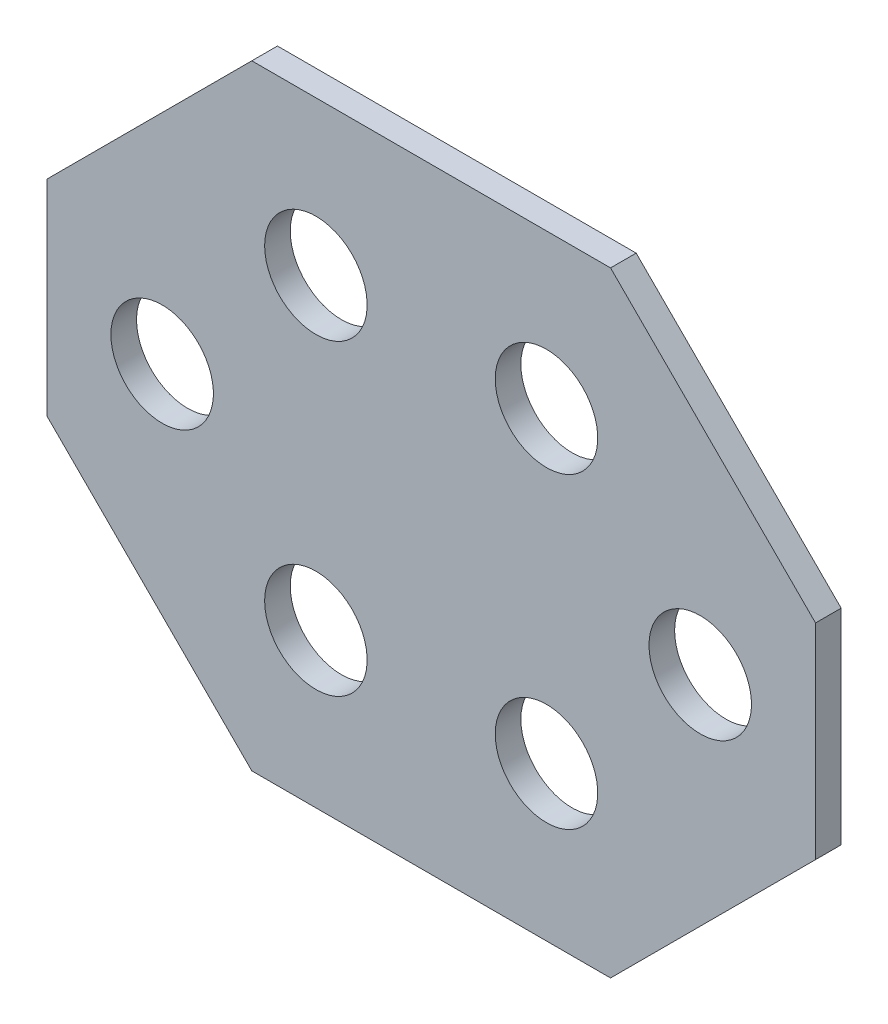
ISO-10303-21;
HEADER;
FILE_DESCRIPTION(('STEP AP214'),'2;1');
FILE_NAME('part.step','',(''),(''),'','','');
FILE_SCHEMA(('AUTOMOTIVE_DESIGN { 1 0 10303 214 1 1 1 1 }'));
ENDSEC;
DATA;
#1=APPLICATION_CONTEXT('core data for automotive mechanical design processes');
#2=APPLICATION_PROTOCOL_DEFINITION('international standard','automotive_design',2000,#1);
#3=PRODUCT_CONTEXT('',#1,'mechanical');
#4=PRODUCT('Part','Part','',(#3));
#5=PRODUCT_RELATED_PRODUCT_CATEGORY('part','',(#4));
#6=PRODUCT_DEFINITION_FORMATION('','',#4);
#7=PRODUCT_DEFINITION_CONTEXT('part definition',#1,'design');
#8=PRODUCT_DEFINITION('design','',#6,#7);
#9=PRODUCT_DEFINITION_SHAPE('','',#8);
#10=(LENGTH_UNIT() NAMED_UNIT(*) SI_UNIT(.MILLI.,.METRE.));
#11=(NAMED_UNIT(*) PLANE_ANGLE_UNIT() SI_UNIT($,.RADIAN.));
#12=(NAMED_UNIT(*) SI_UNIT($,.STERADIAN.) SOLID_ANGLE_UNIT());
#13=UNCERTAINTY_MEASURE_WITH_UNIT(LENGTH_MEASURE(1.E-05),#10,'distance_accuracy_value','');
#14=(GEOMETRIC_REPRESENTATION_CONTEXT(3) GLOBAL_UNCERTAINTY_ASSIGNED_CONTEXT((#13)) GLOBAL_UNIT_ASSIGNED_CONTEXT((#10,
#11,#12)) REPRESENTATION_CONTEXT('',''));
#15=CARTESIAN_POINT('',(0.,0.,0.));
#16=DIRECTION('',(0.,0.,1.));
#17=DIRECTION('',(1.,0.,0.));
#18=AXIS2_PLACEMENT_3D('',#15,#16,#17);
#19=CARTESIAN_POINT('',(15.,-12.,1.));
#20=DIRECTION('',(0.,-1.,0.));
#21=DIRECTION('',(1.,0.,0.));
#22=AXIS2_PLACEMENT_3D('',#19,#20,#21);
#23=PLANE('',#22);
#24=DIRECTION('',(-1.,0.,0.));
#25=VECTOR('',#24,1.);
#26=CARTESIAN_POINT('',(15.,-12.,1.));
#27=LINE('',#26,#25);
#28=CARTESIAN_POINT('',(6.99999999999997,-12.,1.));
#29=VERTEX_POINT('',#28);
#30=CARTESIAN_POINT('',(-7.,-12.,1.));
#31=VERTEX_POINT('',#30);
#32=EDGE_CURVE('E154',#29,#31,#27,.T.);
#33=ORIENTED_EDGE('',*,*,#32,.T.);
#34=DIRECTION('',(0.,0.,-1.));
#35=VECTOR('',#34,1.);
#36=CARTESIAN_POINT('',(-7.,-12.,1.));
#37=LINE('',#36,#35);
#38=CARTESIAN_POINT('',(-7.,-12.,0.));
#39=VERTEX_POINT('',#38);
#40=EDGE_CURVE('E150',#31,#39,#37,.T.);
#41=ORIENTED_EDGE('',*,*,#40,.T.);
#42=DIRECTION('',(-1.,0.,0.));
#43=VECTOR('',#42,1.);
#44=CARTESIAN_POINT('',(15.,-12.,0.));
#45=LINE('',#44,#43);
#46=CARTESIAN_POINT('',(6.99999999999997,-12.,0.));
#47=VERTEX_POINT('',#46);
#48=EDGE_CURVE('E103',#47,#39,#45,.T.);
#49=ORIENTED_EDGE('',*,*,#48,.F.);
#50=DIRECTION('',(0.,0.,1.));
#51=VECTOR('',#50,1.);
#52=CARTESIAN_POINT('',(6.99999999999997,-12.,1.));
#53=LINE('',#52,#51);
#54=EDGE_CURVE('E148',#47,#29,#53,.T.);
#55=ORIENTED_EDGE('',*,*,#54,.T.);
#56=EDGE_LOOP('',(#33,#41,#49,#55));
#57=FACE_BOUND('',#56,.T.);
#58=ADVANCED_FACE('F32',(#57),#23,.T.);
#59=CARTESIAN_POINT('',(15.,-12.,1.));
#60=DIRECTION('',(-1.,0.,0.));
#61=DIRECTION('',(0.,0.,1.));
#62=AXIS2_PLACEMENT_3D('',#59,#60,#61);
#63=PLANE('',#62);
#64=DIRECTION('',(0.,1.,0.));
#65=VECTOR('',#64,1.);
#66=CARTESIAN_POINT('',(15.,-12.,1.));
#67=LINE('',#66,#65);
#68=CARTESIAN_POINT('',(15.,-3.99999999999999,1.));
#69=VERTEX_POINT('',#68);
#70=CARTESIAN_POINT('',(15.,3.99999999999997,1.));
#71=VERTEX_POINT('',#70);
#72=EDGE_CURVE('E124',#69,#71,#67,.T.);
#73=ORIENTED_EDGE('',*,*,#72,.F.);
#74=DIRECTION('',(0.,0.,-1.));
#75=VECTOR('',#74,1.);
#76=CARTESIAN_POINT('',(15.,-3.99999999999999,0.));
#77=LINE('',#76,#75);
#78=CARTESIAN_POINT('',(15.,-3.99999999999999,0.));
#79=VERTEX_POINT('',#78);
#80=EDGE_CURVE('E11',#69,#79,#77,.T.);
#81=ORIENTED_EDGE('',*,*,#80,.T.);
#82=DIRECTION('',(0.,1.,0.));
#83=VECTOR('',#82,1.);
#84=CARTESIAN_POINT('',(15.,-12.,0.));
#85=LINE('',#84,#83);
#86=CARTESIAN_POINT('',(15.,3.99999999999997,0.));
#87=VERTEX_POINT('',#86);
#88=EDGE_CURVE('E131',#79,#87,#85,.T.);
#89=ORIENTED_EDGE('',*,*,#88,.T.);
#90=DIRECTION('',(0.,0.,1.));
#91=VECTOR('',#90,1.);
#92=CARTESIAN_POINT('',(15.,3.99999999999997,1.));
#93=LINE('',#92,#91);
#94=EDGE_CURVE('E40',#87,#71,#93,.T.);
#95=ORIENTED_EDGE('',*,*,#94,.T.);
#96=EDGE_LOOP('',(#73,#81,#89,#95));
#97=FACE_BOUND('',#96,.T.);
#98=ADVANCED_FACE('F178',(#97),#63,.F.);
#99=CARTESIAN_POINT('',(15.,12.,1.));
#100=DIRECTION('',(0.,-1.,0.));
#101=DIRECTION('',(1.,0.,0.));
#102=AXIS2_PLACEMENT_3D('',#99,#100,#101);
#103=PLANE('',#102);
#104=DIRECTION('',(-1.,0.,0.));
#105=VECTOR('',#104,1.);
#106=CARTESIAN_POINT('',(15.,12.,0.));
#107=LINE('',#106,#105);
#108=CARTESIAN_POINT('',(6.99999999999999,12.,0.));
#109=VERTEX_POINT('',#108);
#110=CARTESIAN_POINT('',(-6.99999999999997,12.,0.));
#111=VERTEX_POINT('',#110);
#112=EDGE_CURVE('E119',#109,#111,#107,.T.);
#113=ORIENTED_EDGE('',*,*,#112,.T.);
#114=DIRECTION('',(0.,0.,1.));
#115=VECTOR('',#114,1.);
#116=CARTESIAN_POINT('',(-6.99999999999997,12.,1.));
#117=LINE('',#116,#115);
#118=CARTESIAN_POINT('',(-6.99999999999997,12.,1.));
#119=VERTEX_POINT('',#118);
#120=EDGE_CURVE('E140',#111,#119,#117,.T.);
#121=ORIENTED_EDGE('',*,*,#120,.T.);
#122=DIRECTION('',(-1.,0.,0.));
#123=VECTOR('',#122,1.);
#124=CARTESIAN_POINT('',(15.,12.,1.));
#125=LINE('',#124,#123);
#126=CARTESIAN_POINT('',(6.99999999999999,12.,1.));
#127=VERTEX_POINT('',#126);
#128=EDGE_CURVE('E128',#127,#119,#125,.T.);
#129=ORIENTED_EDGE('',*,*,#128,.F.);
#130=DIRECTION('',(0.,0.,-1.));
#131=VECTOR('',#130,1.);
#132=CARTESIAN_POINT('',(6.99999999999999,12.,1.));
#133=LINE('',#132,#131);
#134=EDGE_CURVE('E137',#127,#109,#133,.T.);
#135=ORIENTED_EDGE('',*,*,#134,.T.);
#136=EDGE_LOOP('',(#113,#121,#129,#135));
#137=FACE_BOUND('',#136,.T.);
#138=ADVANCED_FACE('F168',(#137),#103,.F.);
#139=CARTESIAN_POINT('',(-15.,-12.,1.));
#140=DIRECTION('',(-1.,0.,0.));
#141=DIRECTION('',(0.,0.,1.));
#142=AXIS2_PLACEMENT_3D('',#139,#140,#141);
#143=PLANE('',#142);
#144=DIRECTION('',(0.,1.,0.));
#145=VECTOR('',#144,1.);
#146=CARTESIAN_POINT('',(-15.,-12.,1.));
#147=LINE('',#146,#145);
#148=CARTESIAN_POINT('',(-15.,-3.99999999999998,1.));
#149=VERTEX_POINT('',#148);
#150=CARTESIAN_POINT('',(-15.,4.,1.));
#151=VERTEX_POINT('',#150);
#152=EDGE_CURVE('E155',#149,#151,#147,.T.);
#153=ORIENTED_EDGE('',*,*,#152,.T.);
#154=DIRECTION('',(0.,0.,-1.));
#155=VECTOR('',#154,1.);
#156=CARTESIAN_POINT('',(-15.,4.,0.));
#157=LINE('',#156,#155);
#158=CARTESIAN_POINT('',(-15.,4.,0.));
#159=VERTEX_POINT('',#158);
#160=EDGE_CURVE('E118',#151,#159,#157,.T.);
#161=ORIENTED_EDGE('',*,*,#160,.T.);
#162=DIRECTION('',(0.,1.,0.));
#163=VECTOR('',#162,1.);
#164=CARTESIAN_POINT('',(-15.,-12.,0.));
#165=LINE('',#164,#163);
#166=CARTESIAN_POINT('',(-15.,-3.99999999999998,0.));
#167=VERTEX_POINT('',#166);
#168=EDGE_CURVE('E101',#167,#159,#165,.T.);
#169=ORIENTED_EDGE('',*,*,#168,.F.);
#170=DIRECTION('',(0.,0.,1.));
#171=VECTOR('',#170,1.);
#172=CARTESIAN_POINT('',(-15.,-3.99999999999998,1.));
#173=LINE('',#172,#171);
#174=EDGE_CURVE('E115',#167,#149,#173,.T.);
#175=ORIENTED_EDGE('',*,*,#174,.T.);
#176=EDGE_LOOP('',(#153,#161,#169,#175));
#177=FACE_BOUND('',#176,.T.);
#178=ADVANCED_FACE('F114',(#177),#143,.T.);
#179=CARTESIAN_POINT('',(0.,0.,1.));
#180=DIRECTION('',(0.,0.,-1.));
#181=DIRECTION('',(-1.,0.,0.));
#182=AXIS2_PLACEMENT_3D('',#179,#180,#181);
#183=PLANE('',#182);
#184=CARTESIAN_POINT('',(-4.5,6.,1.));
#185=DIRECTION('',(0.,0.,-1.));
#186=DIRECTION('',(-1.,0.,0.));
#187=AXIS2_PLACEMENT_3D('',#184,#185,#186);
#188=CIRCLE('',#187,2.);
#189=CARTESIAN_POINT('',(-6.5,6.,1.));
#190=VERTEX_POINT('',#189);
#191=EDGE_CURVE('E329',#190,#190,#188,.F.);
#192=ORIENTED_EDGE('',*,*,#191,.F.);
#193=EDGE_LOOP('',(#192));
#194=FACE_BOUND('',#193,.T.);
#195=CARTESIAN_POINT('',(-4.5,-6.,1.));
#196=DIRECTION('',(0.,0.,-1.));
#197=DIRECTION('',(-1.,0.,0.));
#198=AXIS2_PLACEMENT_3D('',#195,#196,#197);
#199=CIRCLE('',#198,2.);
#200=CARTESIAN_POINT('',(-6.5,-6.,1.));
#201=VERTEX_POINT('',#200);
#202=EDGE_CURVE('E331',#201,#201,#199,.F.);
#203=ORIENTED_EDGE('',*,*,#202,.F.);
#204=EDGE_LOOP('',(#203));
#205=FACE_BOUND('',#204,.T.);
#206=CARTESIAN_POINT('',(-10.5,0.,1.));
#207=DIRECTION('',(0.,0.,-1.));
#208=DIRECTION('',(-1.,0.,0.));
#209=AXIS2_PLACEMENT_3D('',#206,#207,#208);
#210=CIRCLE('',#209,2.);
#211=CARTESIAN_POINT('',(-12.5,0.,1.));
#212=VERTEX_POINT('',#211);
#213=EDGE_CURVE('E337',#212,#212,#210,.F.);
#214=ORIENTED_EDGE('',*,*,#213,.F.);
#215=EDGE_LOOP('',(#214));
#216=FACE_BOUND('',#215,.T.);
#217=CARTESIAN_POINT('',(4.5,6.,1.));
#218=DIRECTION('',(0.,0.,-1.));
#219=DIRECTION('',(-1.,0.,0.));
#220=AXIS2_PLACEMENT_3D('',#217,#218,#219);
#221=CIRCLE('',#220,2.);
#222=CARTESIAN_POINT('',(2.5,6.,1.));
#223=VERTEX_POINT('',#222);
#224=EDGE_CURVE('E159',#223,#223,#221,.T.);
#225=ORIENTED_EDGE('',*,*,#224,.T.);
#226=EDGE_LOOP('',(#225));
#227=FACE_BOUND('',#226,.T.);
#228=CARTESIAN_POINT('',(4.5,-6.,1.));
#229=DIRECTION('',(0.,0.,-1.));
#230=DIRECTION('',(-1.,0.,0.));
#231=AXIS2_PLACEMENT_3D('',#228,#229,#230);
#232=CIRCLE('',#231,2.);
#233=CARTESIAN_POINT('',(2.5,-6.,1.));
#234=VERTEX_POINT('',#233);
#235=EDGE_CURVE('E347',#234,#234,#232,.T.);
#236=ORIENTED_EDGE('',*,*,#235,.T.);
#237=EDGE_LOOP('',(#236));
#238=FACE_BOUND('',#237,.T.);
#239=CARTESIAN_POINT('',(10.5,0.,1.));
#240=DIRECTION('',(0.,0.,-1.));
#241=DIRECTION('',(-1.,0.,0.));
#242=AXIS2_PLACEMENT_3D('',#239,#240,#241);
#243=CIRCLE('',#242,2.);
#244=CARTESIAN_POINT('',(8.5,0.,1.));
#245=VERTEX_POINT('',#244);
#246=EDGE_CURVE('E343',#245,#245,#243,.T.);
#247=ORIENTED_EDGE('',*,*,#246,.T.);
#248=EDGE_LOOP('',(#247));
#249=FACE_BOUND('',#248,.T.);
#250=ORIENTED_EDGE('',*,*,#128,.T.);
#251=DIRECTION('',(-0.707106781186549,-0.707106781186546,0.));
#252=VECTOR('',#251,1.);
#253=CARTESIAN_POINT('',(-15.,4.,1.));
#254=LINE('',#253,#252);
#255=EDGE_CURVE('E146',#119,#151,#254,.T.);
#256=ORIENTED_EDGE('',*,*,#255,.T.);
#257=ORIENTED_EDGE('',*,*,#152,.F.);
#258=DIRECTION('',(-0.707106781186547,0.707106781186549,0.));
#259=VECTOR('',#258,1.);
#260=CARTESIAN_POINT('',(-7.,-12.,1.));
#261=LINE('',#260,#259);
#262=EDGE_CURVE('E123',#149,#31,#261,.F.);
#263=ORIENTED_EDGE('',*,*,#262,.T.);
#264=ORIENTED_EDGE('',*,*,#32,.F.);
#265=DIRECTION('',(0.707106781186549,0.707106781186547,0.));
#266=VECTOR('',#265,1.);
#267=CARTESIAN_POINT('',(15.,-3.99999999999999,1.));
#268=LINE('',#267,#266);
#269=EDGE_CURVE('E53',#29,#69,#268,.T.);
#270=ORIENTED_EDGE('',*,*,#269,.T.);
#271=ORIENTED_EDGE('',*,*,#72,.T.);
#272=DIRECTION('',(0.707106781186547,-0.707106781186549,0.));
#273=VECTOR('',#272,1.);
#274=CARTESIAN_POINT('',(6.99999999999999,12.,1.));
#275=LINE('',#274,#273);
#276=EDGE_CURVE('E142',#71,#127,#275,.F.);
#277=ORIENTED_EDGE('',*,*,#276,.T.);
#278=EDGE_LOOP('',(#250,#256,#257,#263,#264,#270,#271,#277));
#279=FACE_BOUND('',#278,.T.);
#280=ADVANCED_FACE('F174',(#194,#205,#216,#227,#238,#249,#279),#183,.F.);
#281=CARTESIAN_POINT('',(0.,0.,0.));
#282=DIRECTION('',(0.,0.,-1.));
#283=DIRECTION('',(-1.,0.,0.));
#284=AXIS2_PLACEMENT_3D('',#281,#282,#283);
#285=PLANE('',#284);
#286=CARTESIAN_POINT('',(-4.5,6.,0.));
#287=DIRECTION('',(0.,0.,1.));
#288=DIRECTION('',(1.,0.,0.));
#289=AXIS2_PLACEMENT_3D('',#286,#287,#288);
#290=CIRCLE('',#289,2.);
#291=CARTESIAN_POINT('',(-2.5,6.,0.));
#292=VERTEX_POINT('',#291);
#293=EDGE_CURVE('E326',#292,#292,#290,.T.);
#294=ORIENTED_EDGE('',*,*,#293,.T.);
#295=EDGE_LOOP('',(#294));
#296=FACE_BOUND('',#295,.T.);
#297=CARTESIAN_POINT('',(-4.5,-6.,0.));
#298=DIRECTION('',(0.,0.,1.));
#299=DIRECTION('',(1.,0.,0.));
#300=AXIS2_PLACEMENT_3D('',#297,#298,#299);
#301=CIRCLE('',#300,2.);
#302=CARTESIAN_POINT('',(-2.5,-6.,0.));
#303=VERTEX_POINT('',#302);
#304=EDGE_CURVE('E369',#303,#303,#301,.T.);
#305=ORIENTED_EDGE('',*,*,#304,.T.);
#306=EDGE_LOOP('',(#305));
#307=FACE_BOUND('',#306,.T.);
#308=CARTESIAN_POINT('',(-10.5,0.,0.));
#309=DIRECTION('',(0.,0.,1.));
#310=DIRECTION('',(1.,0.,0.));
#311=AXIS2_PLACEMENT_3D('',#308,#309,#310);
#312=CIRCLE('',#311,2.);
#313=CARTESIAN_POINT('',(-8.5,0.,0.));
#314=VERTEX_POINT('',#313);
#315=EDGE_CURVE('E366',#314,#314,#312,.T.);
#316=ORIENTED_EDGE('',*,*,#315,.T.);
#317=EDGE_LOOP('',(#316));
#318=FACE_BOUND('',#317,.T.);
#319=CARTESIAN_POINT('',(4.5,6.,0.));
#320=DIRECTION('',(0.,0.,-1.));
#321=DIRECTION('',(-1.,0.,0.));
#322=AXIS2_PLACEMENT_3D('',#319,#320,#321);
#323=CIRCLE('',#322,2.);
#324=CARTESIAN_POINT('',(2.5,6.,0.));
#325=VERTEX_POINT('',#324);
#326=EDGE_CURVE('E341',#325,#325,#323,.T.);
#327=ORIENTED_EDGE('',*,*,#326,.F.);
#328=EDGE_LOOP('',(#327));
#329=FACE_BOUND('',#328,.T.);
#330=CARTESIAN_POINT('',(4.5,-6.,0.));
#331=DIRECTION('',(0.,0.,-1.));
#332=DIRECTION('',(-1.,0.,0.));
#333=AXIS2_PLACEMENT_3D('',#330,#331,#332);
#334=CIRCLE('',#333,2.);
#335=CARTESIAN_POINT('',(2.5,-6.,0.));
#336=VERTEX_POINT('',#335);
#337=EDGE_CURVE('E334',#336,#336,#334,.T.);
#338=ORIENTED_EDGE('',*,*,#337,.F.);
#339=EDGE_LOOP('',(#338));
#340=FACE_BOUND('',#339,.T.);
#341=CARTESIAN_POINT('',(10.5,0.,0.));
#342=DIRECTION('',(0.,0.,-1.));
#343=DIRECTION('',(-1.,0.,0.));
#344=AXIS2_PLACEMENT_3D('',#341,#342,#343);
#345=CIRCLE('',#344,2.);
#346=CARTESIAN_POINT('',(8.5,0.,0.));
#347=VERTEX_POINT('',#346);
#348=EDGE_CURVE('E330',#347,#347,#345,.T.);
#349=ORIENTED_EDGE('',*,*,#348,.F.);
#350=EDGE_LOOP('',(#349));
#351=FACE_BOUND('',#350,.T.);
#352=ORIENTED_EDGE('',*,*,#168,.T.);
#353=DIRECTION('',(0.707106781186549,0.707106781186546,0.));
#354=VECTOR('',#353,1.);
#355=CARTESIAN_POINT('',(-9.49999999999997,9.50000000000001,0.));
#356=LINE('',#355,#354);
#357=EDGE_CURVE('E108',#159,#111,#356,.T.);
#358=ORIENTED_EDGE('',*,*,#357,.T.);
#359=ORIENTED_EDGE('',*,*,#112,.F.);
#360=DIRECTION('',(-0.707106781186547,0.707106781186549,0.));
#361=VECTOR('',#360,1.);
#362=CARTESIAN_POINT('',(9.50000000000001,9.49999999999998,0.));
#363=LINE('',#362,#361);
#364=EDGE_CURVE('E126',#109,#87,#363,.F.);
#365=ORIENTED_EDGE('',*,*,#364,.T.);
#366=ORIENTED_EDGE('',*,*,#88,.F.);
#367=DIRECTION('',(-0.707106781186549,-0.707106781186547,0.));
#368=VECTOR('',#367,1.);
#369=CARTESIAN_POINT('',(9.49999999999998,-9.5,0.));
#370=LINE('',#369,#368);
#371=EDGE_CURVE('E109',#79,#47,#370,.T.);
#372=ORIENTED_EDGE('',*,*,#371,.T.);
#373=ORIENTED_EDGE('',*,*,#48,.T.);
#374=DIRECTION('',(0.707106781186547,-0.707106781186549,0.));
#375=VECTOR('',#374,1.);
#376=CARTESIAN_POINT('',(-9.50000000000001,-9.49999999999999,0.));
#377=LINE('',#376,#375);
#378=EDGE_CURVE('E98',#39,#167,#377,.F.);
#379=ORIENTED_EDGE('',*,*,#378,.T.);
#380=EDGE_LOOP('',(#352,#358,#359,#365,#366,#372,#373,#379));
#381=FACE_BOUND('',#380,.T.);
#382=ADVANCED_FACE('F100',(#296,#307,#318,#329,#340,#351,#381),#285,.T.);
#383=CARTESIAN_POINT('',(10.5,0.,3.));
#384=DIRECTION('',(0.,0.,-1.));
#385=DIRECTION('',(-1.,0.,0.));
#386=AXIS2_PLACEMENT_3D('',#383,#384,#385);
#387=CYLINDRICAL_SURFACE('',#386,2.);
#388=ORIENTED_EDGE('',*,*,#348,.T.);
#389=EDGE_LOOP('',(#388));
#390=FACE_BOUND('',#389,.T.);
#391=ORIENTED_EDGE('',*,*,#246,.F.);
#392=EDGE_LOOP('',(#391));
#393=FACE_BOUND('',#392,.T.);
#394=ADVANCED_FACE('F209',(#390,#393),#387,.F.);
#395=CARTESIAN_POINT('',(4.5,-6.,3.));
#396=DIRECTION('',(0.,0.,-1.));
#397=DIRECTION('',(-1.,0.,0.));
#398=AXIS2_PLACEMENT_3D('',#395,#396,#397);
#399=CYLINDRICAL_SURFACE('',#398,2.);
#400=ORIENTED_EDGE('',*,*,#337,.T.);
#401=EDGE_LOOP('',(#400));
#402=FACE_BOUND('',#401,.T.);
#403=ORIENTED_EDGE('',*,*,#235,.F.);
#404=EDGE_LOOP('',(#403));
#405=FACE_BOUND('',#404,.T.);
#406=ADVANCED_FACE('F203',(#402,#405),#399,.F.);
#407=CARTESIAN_POINT('',(4.5,6.,3.));
#408=DIRECTION('',(0.,0.,-1.));
#409=DIRECTION('',(-1.,0.,0.));
#410=AXIS2_PLACEMENT_3D('',#407,#408,#409);
#411=CYLINDRICAL_SURFACE('',#410,2.);
#412=ORIENTED_EDGE('',*,*,#326,.T.);
#413=EDGE_LOOP('',(#412));
#414=FACE_BOUND('',#413,.T.);
#415=ORIENTED_EDGE('',*,*,#224,.F.);
#416=EDGE_LOOP('',(#415));
#417=FACE_BOUND('',#416,.T.);
#418=ADVANCED_FACE('F199',(#414,#417),#411,.F.);
#419=CARTESIAN_POINT('',(-15.,4.,1.));
#420=DIRECTION('',(-0.707106781186546,0.707106781186549,0.));
#421=DIRECTION('',(0.,0.,1.));
#422=AXIS2_PLACEMENT_3D('',#419,#420,#421);
#423=PLANE('',#422);
#424=ORIENTED_EDGE('',*,*,#255,.F.);
#425=ORIENTED_EDGE('',*,*,#120,.F.);
#426=ORIENTED_EDGE('',*,*,#357,.F.);
#427=ORIENTED_EDGE('',*,*,#160,.F.);
#428=EDGE_LOOP('',(#424,#425,#426,#427));
#429=FACE_BOUND('',#428,.T.);
#430=ADVANCED_FACE('F173',(#429),#423,.T.);
#431=CARTESIAN_POINT('',(-7.,-12.,1.));
#432=DIRECTION('',(0.707106781186549,0.707106781186547,0.));
#433=DIRECTION('',(0.,0.,-1.));
#434=AXIS2_PLACEMENT_3D('',#431,#432,#433);
#435=PLANE('',#434);
#436=ORIENTED_EDGE('',*,*,#262,.F.);
#437=ORIENTED_EDGE('',*,*,#174,.F.);
#438=ORIENTED_EDGE('',*,*,#378,.F.);
#439=ORIENTED_EDGE('',*,*,#40,.F.);
#440=EDGE_LOOP('',(#436,#437,#438,#439));
#441=FACE_BOUND('',#440,.T.);
#442=ADVANCED_FACE('F122',(#441),#435,.F.);
#443=CARTESIAN_POINT('',(15.,-3.99999999999999,1.));
#444=DIRECTION('',(0.707106781186547,-0.707106781186549,0.));
#445=DIRECTION('',(0.,0.,1.));
#446=AXIS2_PLACEMENT_3D('',#443,#444,#445);
#447=PLANE('',#446);
#448=ORIENTED_EDGE('',*,*,#269,.F.);
#449=ORIENTED_EDGE('',*,*,#54,.F.);
#450=ORIENTED_EDGE('',*,*,#371,.F.);
#451=ORIENTED_EDGE('',*,*,#80,.F.);
#452=EDGE_LOOP('',(#448,#449,#450,#451));
#453=FACE_BOUND('',#452,.T.);
#454=ADVANCED_FACE('F181',(#453),#447,.T.);
#455=CARTESIAN_POINT('',(6.99999999999999,12.,1.));
#456=DIRECTION('',(-0.707106781186548,-0.707106781186546,0.));
#457=DIRECTION('',(0.,0.,-1.));
#458=AXIS2_PLACEMENT_3D('',#455,#456,#457);
#459=PLANE('',#458);
#460=ORIENTED_EDGE('',*,*,#276,.F.);
#461=ORIENTED_EDGE('',*,*,#94,.F.);
#462=ORIENTED_EDGE('',*,*,#364,.F.);
#463=ORIENTED_EDGE('',*,*,#134,.F.);
#464=EDGE_LOOP('',(#460,#461,#462,#463));
#465=FACE_BOUND('',#464,.T.);
#466=ADVANCED_FACE('F34',(#465),#459,.F.);
#467=CARTESIAN_POINT('',(-10.5,0.,3.));
#468=DIRECTION('',(0.,0.,-1.));
#469=DIRECTION('',(-1.,0.,0.));
#470=AXIS2_PLACEMENT_3D('',#467,#468,#469);
#471=CYLINDRICAL_SURFACE('',#470,2.);
#472=ORIENTED_EDGE('',*,*,#315,.F.);
#473=EDGE_LOOP('',(#472));
#474=FACE_BOUND('',#473,.T.);
#475=ORIENTED_EDGE('',*,*,#213,.T.);
#476=EDGE_LOOP('',(#475));
#477=FACE_BOUND('',#476,.T.);
#478=ADVANCED_FACE('F187',(#474,#477),#471,.F.);
#479=CARTESIAN_POINT('',(-4.5,-6.,3.));
#480=DIRECTION('',(0.,0.,-1.));
#481=DIRECTION('',(-1.,0.,0.));
#482=AXIS2_PLACEMENT_3D('',#479,#480,#481);
#483=CYLINDRICAL_SURFACE('',#482,2.);
#484=ORIENTED_EDGE('',*,*,#304,.F.);
#485=EDGE_LOOP('',(#484));
#486=FACE_BOUND('',#485,.T.);
#487=ORIENTED_EDGE('',*,*,#202,.T.);
#488=EDGE_LOOP('',(#487));
#489=FACE_BOUND('',#488,.T.);
#490=ADVANCED_FACE('F301',(#486,#489),#483,.F.);
#491=CARTESIAN_POINT('',(-4.5,6.,3.));
#492=DIRECTION('',(0.,0.,-1.));
#493=DIRECTION('',(-1.,0.,0.));
#494=AXIS2_PLACEMENT_3D('',#491,#492,#493);
#495=CYLINDRICAL_SURFACE('',#494,2.);
#496=ORIENTED_EDGE('',*,*,#293,.F.);
#497=EDGE_LOOP('',(#496));
#498=FACE_BOUND('',#497,.T.);
#499=ORIENTED_EDGE('',*,*,#191,.T.);
#500=EDGE_LOOP('',(#499));
#501=FACE_BOUND('',#500,.T.);
#502=ADVANCED_FACE('F309',(#498,#501),#495,.F.);
#503=CLOSED_SHELL('',(#58,#98,#138,#178,#280,#382,#394,#406,#418,#430,#442,#454,#466,#478,#490,#502));
#504=MANIFOLD_SOLID_BREP('B2',#503);
#505=ADVANCED_BREP_SHAPE_REPRESENTATION('',(#18,#504),#14);
#506=SHAPE_DEFINITION_REPRESENTATION(#9,#505);
ENDSEC;
END-ISO-10303-21;
